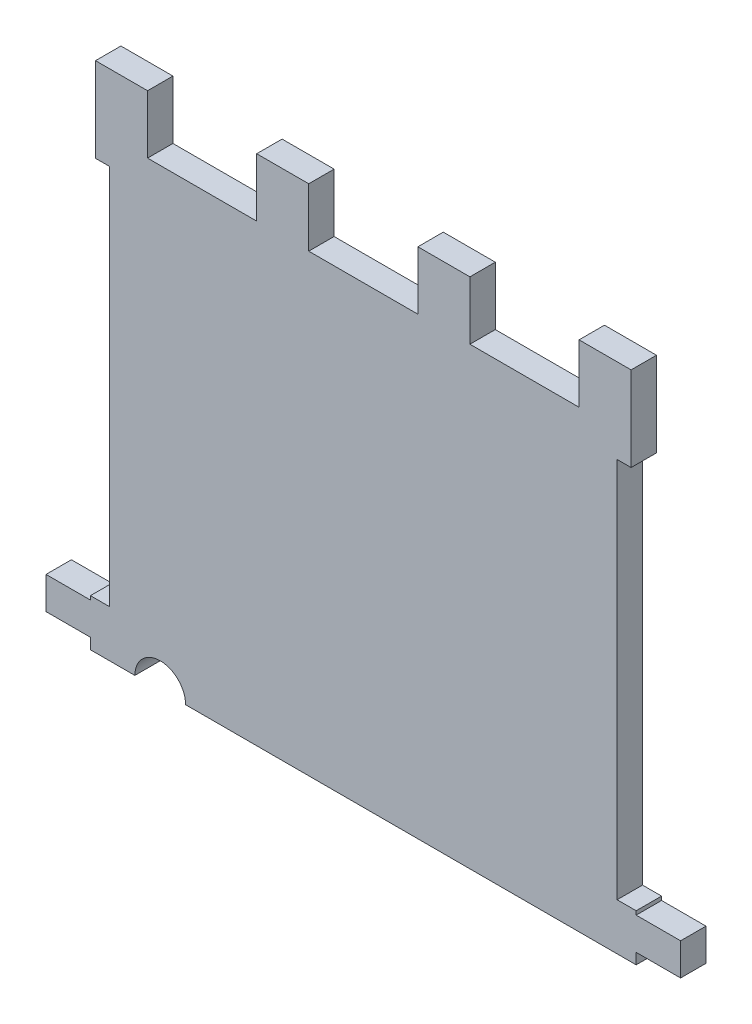
ISO-10303-21;
HEADER;
FILE_DESCRIPTION(('STEP AP214'),'2;1');
FILE_NAME('part.step','',(''),(''),'','','');
FILE_SCHEMA(('AUTOMOTIVE_DESIGN { 1 0 10303 214 1 1 1 1 }'));
ENDSEC;
DATA;
#1=APPLICATION_CONTEXT('core data for automotive mechanical design processes');
#2=APPLICATION_PROTOCOL_DEFINITION('international standard','automotive_design',2000,#1);
#3=PRODUCT_CONTEXT('',#1,'mechanical');
#4=PRODUCT('Part','Part','',(#3));
#5=PRODUCT_RELATED_PRODUCT_CATEGORY('part','',(#4));
#6=PRODUCT_DEFINITION_FORMATION('','',#4);
#7=PRODUCT_DEFINITION_CONTEXT('part definition',#1,'design');
#8=PRODUCT_DEFINITION('design','',#6,#7);
#9=PRODUCT_DEFINITION_SHAPE('','',#8);
#10=(LENGTH_UNIT() NAMED_UNIT(*) SI_UNIT(.MILLI.,.METRE.));
#11=(NAMED_UNIT(*) PLANE_ANGLE_UNIT() SI_UNIT($,.RADIAN.));
#12=(NAMED_UNIT(*) SI_UNIT($,.STERADIAN.) SOLID_ANGLE_UNIT());
#13=UNCERTAINTY_MEASURE_WITH_UNIT(LENGTH_MEASURE(1.E-05),#10,'distance_accuracy_value','');
#14=(GEOMETRIC_REPRESENTATION_CONTEXT(3) GLOBAL_UNCERTAINTY_ASSIGNED_CONTEXT((#13)) GLOBAL_UNIT_ASSIGNED_CONTEXT((#10,
#11,#12)) REPRESENTATION_CONTEXT('',''));
#15=CARTESIAN_POINT('',(0.,0.,0.));
#16=DIRECTION('',(0.,0.,1.));
#17=DIRECTION('',(1.,0.,0.));
#18=AXIS2_PLACEMENT_3D('',#15,#16,#17);
#19=CARTESIAN_POINT('',(2.15,-0.700638104142,0.));
#20=DIRECTION('',(1.,0.,0.));
#21=DIRECTION('',(0.,1.,0.));
#22=AXIS2_PLACEMENT_3D('',#19,#20,#21);
#23=PLANE('',#22);
#24=DIRECTION('',(0.,0.,1.));
#25=VECTOR('',#24,1.);
#26=CARTESIAN_POINT('',(2.15,-0.700638104142,0.));
#27=LINE('',#26,#25);
#28=CARTESIAN_POINT('',(2.15,-0.700638104142,0.));
#29=VERTEX_POINT('',#28);
#30=CARTESIAN_POINT('',(2.15,-0.700638104142,0.2));
#31=VERTEX_POINT('',#30);
#32=EDGE_CURVE('E309',#29,#31,#27,.T.);
#33=ORIENTED_EDGE('',*,*,#32,.F.);
#34=DIRECTION('',(0.,1.,0.));
#35=VECTOR('',#34,1.);
#36=CARTESIAN_POINT('',(2.15,-0.700638104142,0.));
#37=LINE('',#36,#35);
#38=CARTESIAN_POINT('',(2.15,-0.670638104142,0.));
#39=VERTEX_POINT('',#38);
#40=EDGE_CURVE('E362',#29,#39,#37,.T.);
#41=ORIENTED_EDGE('',*,*,#40,.T.);
#42=DIRECTION('',(0.,0.,1.));
#43=VECTOR('',#42,1.);
#44=CARTESIAN_POINT('',(2.15,-0.670638104142,0.));
#45=LINE('',#44,#43);
#46=CARTESIAN_POINT('',(2.15,-0.670638104142,0.2));
#47=VERTEX_POINT('',#46);
#48=EDGE_CURVE('E312',#47,#39,#45,.F.);
#49=ORIENTED_EDGE('',*,*,#48,.F.);
#50=DIRECTION('',(0.,1.,0.));
#51=VECTOR('',#50,1.);
#52=CARTESIAN_POINT('',(2.15,0.,0.2));
#53=LINE('',#52,#51);
#54=EDGE_CURVE('E359',#47,#31,#53,.F.);
#55=ORIENTED_EDGE('',*,*,#54,.T.);
#56=EDGE_LOOP('',(#33,#41,#49,#55));
#57=FACE_BOUND('',#56,.T.);
#58=ADVANCED_FACE('F17',(#57),#23,.T.);
#59=CARTESIAN_POINT('',(-2.15,-0.670638104142,0.));
#60=DIRECTION('',(-1.,0.,0.));
#61=DIRECTION('',(0.,-1.,0.));
#62=AXIS2_PLACEMENT_3D('',#59,#60,#61);
#63=PLANE('',#62);
#64=DIRECTION('',(0.,0.,1.));
#65=VECTOR('',#64,1.);
#66=CARTESIAN_POINT('',(-2.15,-0.670638104142,0.));
#67=LINE('',#66,#65);
#68=CARTESIAN_POINT('',(-2.15,-0.670638104142,0.));
#69=VERTEX_POINT('',#68);
#70=CARTESIAN_POINT('',(-2.15,-0.670638104142,0.2));
#71=VERTEX_POINT('',#70);
#72=EDGE_CURVE('E491',#69,#71,#67,.T.);
#73=ORIENTED_EDGE('',*,*,#72,.F.);
#74=DIRECTION('',(0.,-1.,0.));
#75=VECTOR('',#74,1.);
#76=CARTESIAN_POINT('',(-2.15,-0.670638104142,0.));
#77=LINE('',#76,#75);
#78=CARTESIAN_POINT('',(-2.15,-0.700638104142,0.));
#79=VERTEX_POINT('',#78);
#80=EDGE_CURVE('E360',#69,#79,#77,.T.);
#81=ORIENTED_EDGE('',*,*,#80,.T.);
#82=DIRECTION('',(0.,0.,1.));
#83=VECTOR('',#82,1.);
#84=CARTESIAN_POINT('',(-2.15,-0.700638104142,0.));
#85=LINE('',#84,#83);
#86=CARTESIAN_POINT('',(-2.15,-0.700638104142,0.2));
#87=VERTEX_POINT('',#86);
#88=EDGE_CURVE('E494',#87,#79,#85,.F.);
#89=ORIENTED_EDGE('',*,*,#88,.F.);
#90=DIRECTION('',(0.,1.,0.));
#91=VECTOR('',#90,1.);
#92=CARTESIAN_POINT('',(-2.15,0.,0.2));
#93=LINE('',#92,#91);
#94=EDGE_CURVE('E357',#87,#71,#93,.T.);
#95=ORIENTED_EDGE('',*,*,#94,.T.);
#96=EDGE_LOOP('',(#73,#81,#89,#95));
#97=FACE_BOUND('',#96,.T.);
#98=ADVANCED_FACE('F661',(#97),#63,.T.);
#99=CARTESIAN_POINT('',(0.,0.,0.2));
#100=DIRECTION('',(0.,0.,-1.));
#101=DIRECTION('',(-1.,0.,0.));
#102=AXIS2_PLACEMENT_3D('',#99,#100,#101);
#103=PLANE('',#102);
#104=DIRECTION('',(1.,0.,0.));
#105=VECTOR('',#104,1.);
#106=CARTESIAN_POINT('',(-2.11,3.,0.2));
#107=LINE('',#106,#105);
#108=CARTESIAN_POINT('',(-1.7,3.,0.2));
#109=VERTEX_POINT('',#108);
#110=CARTESIAN_POINT('',(-2.11,3.,0.2));
#111=VERTEX_POINT('',#110);
#112=EDGE_CURVE('E472',#109,#111,#107,.F.);
#113=ORIENTED_EDGE('',*,*,#112,.T.);
#114=DIRECTION('',(0.,1.,0.));
#115=VECTOR('',#114,1.);
#116=CARTESIAN_POINT('',(-2.11,2.44,0.2));
#117=LINE('',#116,#115);
#118=CARTESIAN_POINT('',(-2.11,2.333503717557,0.2));
#119=VERTEX_POINT('',#118);
#120=EDGE_CURVE('E476',#111,#119,#117,.F.);
#121=ORIENTED_EDGE('',*,*,#120,.T.);
#122=DIRECTION('',(0.999999999832969,-1.82773427514594E-05,0.));
#123=VECTOR('',#122,1.);
#124=CARTESIAN_POINT('',(-2.11,2.333504722811,0.2));
#125=LINE('',#124,#123);
#126=CARTESIAN_POINT('',(-2.,2.33350271230307,0.2));
#127=VERTEX_POINT('',#126);
#128=EDGE_CURVE('E478',#127,#119,#125,.F.);
#129=ORIENTED_EDGE('',*,*,#128,.F.);
#130=DIRECTION('',(0.,-1.,0.));
#131=VECTOR('',#130,1.);
#132=CARTESIAN_POINT('',(-2.,2.333502712303,0.2));
#133=LINE('',#132,#131);
#134=CARTESIAN_POINT('',(-2.,-0.670638104142,0.2));
#135=VERTEX_POINT('',#134);
#136=EDGE_CURVE('E484',#135,#127,#133,.F.);
#137=ORIENTED_EDGE('',*,*,#136,.F.);
#138=DIRECTION('',(-1.,0.,0.));
#139=VECTOR('',#138,1.);
#140=CARTESIAN_POINT('',(-2.,-0.670638104142,0.2));
#141=LINE('',#140,#139);
#142=EDGE_CURVE('E489',#71,#135,#141,.F.);
#143=ORIENTED_EDGE('',*,*,#142,.F.);
#144=ORIENTED_EDGE('',*,*,#94,.F.);
#145=DIRECTION('',(-1.,0.,0.));
#146=VECTOR('',#145,1.);
#147=CARTESIAN_POINT('',(-2.15,-0.700638104142,0.2));
#148=LINE('',#147,#146);
#149=CARTESIAN_POINT('',(-2.5,-0.700638104142,0.2));
#150=VERTEX_POINT('',#149);
#151=EDGE_CURVE('E497',#150,#87,#148,.F.);
#152=ORIENTED_EDGE('',*,*,#151,.F.);
#153=DIRECTION('',(0.,-1.,0.));
#154=VECTOR('',#153,1.);
#155=CARTESIAN_POINT('',(-2.5,-0.700638104142,0.2));
#156=LINE('',#155,#154);
#157=CARTESIAN_POINT('',(-2.5,-0.954638104142,0.2));
#158=VERTEX_POINT('',#157);
#159=EDGE_CURVE('E503',#158,#150,#156,.F.);
#160=ORIENTED_EDGE('',*,*,#159,.F.);
#161=DIRECTION('',(1.,-1.317019624028E-13,0.));
#162=VECTOR('',#161,1.);
#163=CARTESIAN_POINT('',(-2.5,-0.954638104142,0.2));
#164=LINE('',#163,#162);
#165=CARTESIAN_POINT('',(-2.15,-0.954638104142011,0.2));
#166=VERTEX_POINT('',#165);
#167=EDGE_CURVE('E508',#166,#158,#164,.F.);
#168=ORIENTED_EDGE('',*,*,#167,.F.);
#169=DIRECTION('',(0.,-1.,0.));
#170=VECTOR('',#169,1.);
#171=CARTESIAN_POINT('',(-2.15,-0.954638104142,0.2));
#172=LINE('',#171,#170);
#173=CARTESIAN_POINT('',(-2.15,-1.04,0.2));
#174=VERTEX_POINT('',#173);
#175=EDGE_CURVE('E367',#174,#166,#172,.F.);
#176=ORIENTED_EDGE('',*,*,#175,.F.);
#177=DIRECTION('',(1.,0.,0.));
#178=VECTOR('',#177,1.);
#179=CARTESIAN_POINT('',(-2.15,-1.04,0.2));
#180=LINE('',#179,#178);
#181=CARTESIAN_POINT('',(-1.8,-1.04,0.2));
#182=VERTEX_POINT('',#181);
#183=EDGE_CURVE('E245',#182,#174,#180,.F.);
#184=ORIENTED_EDGE('',*,*,#183,.F.);
#185=CARTESIAN_POINT('',(-1.6,-1.04,0.2));
#186=DIRECTION('',(0.,0.,1.));
#187=DIRECTION('',(1.,0.,0.));
#188=AXIS2_PLACEMENT_3D('',#185,#186,#187);
#189=CIRCLE('',#188,0.2);
#190=CARTESIAN_POINT('',(-1.4,-1.04,0.2));
#191=VERTEX_POINT('',#190);
#192=EDGE_CURVE('E20',#182,#191,#189,.F.);
#193=ORIENTED_EDGE('',*,*,#192,.T.);
#194=DIRECTION('',(1.,0.,0.));
#195=VECTOR('',#194,1.);
#196=CARTESIAN_POINT('',(-1.4,-1.04,0.2));
#197=LINE('',#196,#195);
#198=CARTESIAN_POINT('',(2.15,-1.04,0.2));
#199=VERTEX_POINT('',#198);
#200=EDGE_CURVE('E242',#199,#191,#197,.F.);
#201=ORIENTED_EDGE('',*,*,#200,.F.);
#202=DIRECTION('',(0.,1.,0.));
#203=VECTOR('',#202,1.);
#204=CARTESIAN_POINT('',(2.15,-1.04,0.2));
#205=LINE('',#204,#203);
#206=CARTESIAN_POINT('',(2.15,-0.954638104142,0.2));
#207=VERTEX_POINT('',#206);
#208=EDGE_CURVE('E266',#207,#199,#205,.F.);
#209=ORIENTED_EDGE('',*,*,#208,.F.);
#210=DIRECTION('',(1.,0.,0.));
#211=VECTOR('',#210,1.);
#212=CARTESIAN_POINT('',(2.15,-0.954638104142,0.2));
#213=LINE('',#212,#211);
#214=CARTESIAN_POINT('',(2.5,-0.954638104142,0.2));
#215=VERTEX_POINT('',#214);
#216=EDGE_CURVE('E279',#215,#207,#213,.F.);
#217=ORIENTED_EDGE('',*,*,#216,.F.);
#218=DIRECTION('',(0.,1.,0.));
#219=VECTOR('',#218,1.);
#220=CARTESIAN_POINT('',(2.5,-0.954638104142,0.2));
#221=LINE('',#220,#219);
#222=CARTESIAN_POINT('',(2.5,-0.700638104142,0.2));
#223=VERTEX_POINT('',#222);
#224=EDGE_CURVE('E290',#223,#215,#221,.F.);
#225=ORIENTED_EDGE('',*,*,#224,.F.);
#226=DIRECTION('',(-1.,0.,0.));
#227=VECTOR('',#226,1.);
#228=CARTESIAN_POINT('',(2.5,-0.700638104142,0.2));
#229=LINE('',#228,#227);
#230=EDGE_CURVE('E301',#31,#223,#229,.F.);
#231=ORIENTED_EDGE('',*,*,#230,.F.);
#232=ORIENTED_EDGE('',*,*,#54,.F.);
#233=DIRECTION('',(-1.,0.,0.));
#234=VECTOR('',#233,1.);
#235=CARTESIAN_POINT('',(2.15,-0.670638104142,0.2));
#236=LINE('',#235,#234);
#237=CARTESIAN_POINT('',(2.000020760086,-0.670638104142,0.2));
#238=VERTEX_POINT('',#237);
#239=EDGE_CURVE('E318',#238,#47,#236,.F.);
#240=ORIENTED_EDGE('',*,*,#239,.F.);
#241=DIRECTION('',(-1.82773423832494E-05,0.999999999832969,0.));
#242=VECTOR('',#241,1.);
#243=CARTESIAN_POINT('',(2.000020760086,-0.670638104142,0.2));
#244=LINE('',#243,#242);
#245=CARTESIAN_POINT('',(1.99996585236674,2.333503214462,0.2));
#246=VERTEX_POINT('',#245);
#247=EDGE_CURVE('E319',#246,#238,#244,.F.);
#248=ORIENTED_EDGE('',*,*,#247,.F.);
#249=DIRECTION('',(0.999999999832969,1.82773420736294E-05,0.));
#250=VECTOR('',#249,1.);
#251=CARTESIAN_POINT('',(1.999965852376,2.333502711679,0.2));
#252=LINE('',#251,#250);
#253=CARTESIAN_POINT('',(2.11,2.33350472281094,0.2));
#254=VERTEX_POINT('',#253);
#255=EDGE_CURVE('E324',#254,#246,#252,.F.);
#256=ORIENTED_EDGE('',*,*,#255,.F.);
#257=DIRECTION('',(0.,-1.,0.));
#258=VECTOR('',#257,1.);
#259=CARTESIAN_POINT('',(2.11,3.,0.2));
#260=LINE('',#259,#258);
#261=CARTESIAN_POINT('',(2.11,3.,0.2));
#262=VERTEX_POINT('',#261);
#263=EDGE_CURVE('E331',#254,#262,#260,.F.);
#264=ORIENTED_EDGE('',*,*,#263,.T.);
#265=DIRECTION('',(1.,0.,0.));
#266=VECTOR('',#265,1.);
#267=CARTESIAN_POINT('',(1.7,3.,0.2));
#268=LINE('',#267,#266);
#269=CARTESIAN_POINT('',(1.7,3.,0.2));
#270=VERTEX_POINT('',#269);
#271=EDGE_CURVE('E335',#262,#270,#268,.F.);
#272=ORIENTED_EDGE('',*,*,#271,.T.);
#273=DIRECTION('',(0.,1.,0.));
#274=VECTOR('',#273,1.);
#275=CARTESIAN_POINT('',(1.7,2.44,0.2));
#276=LINE('',#275,#274);
#277=CARTESIAN_POINT('',(1.7,2.540000000001,0.2));
#278=VERTEX_POINT('',#277);
#279=EDGE_CURVE('E337',#270,#278,#276,.F.);
#280=ORIENTED_EDGE('',*,*,#279,.T.);
#281=DIRECTION('',(-1.,0.,0.));
#282=VECTOR('',#281,1.);
#283=CARTESIAN_POINT('',(2.11,2.540000000001,0.2));
#284=LINE('',#283,#282);
#285=CARTESIAN_POINT('',(0.84,2.540000000001,0.2));
#286=VERTEX_POINT('',#285);
#287=EDGE_CURVE('E345',#286,#278,#284,.F.);
#288=ORIENTED_EDGE('',*,*,#287,.F.);
#289=DIRECTION('',(0.,-1.,0.));
#290=VECTOR('',#289,1.);
#291=CARTESIAN_POINT('',(0.84,3.,0.2));
#292=LINE('',#291,#290);
#293=CARTESIAN_POINT('',(0.84,3.,0.2));
#294=VERTEX_POINT('',#293);
#295=EDGE_CURVE('E349',#286,#294,#292,.F.);
#296=ORIENTED_EDGE('',*,*,#295,.T.);
#297=DIRECTION('',(1.,0.,0.));
#298=VECTOR('',#297,1.);
#299=CARTESIAN_POINT('',(0.43,3.,0.2));
#300=LINE('',#299,#298);
#301=CARTESIAN_POINT('',(0.43,3.,0.2));
#302=VERTEX_POINT('',#301);
#303=EDGE_CURVE('E353',#294,#302,#300,.F.);
#304=ORIENTED_EDGE('',*,*,#303,.T.);
#305=DIRECTION('',(0.,1.,0.));
#306=VECTOR('',#305,1.);
#307=CARTESIAN_POINT('',(0.43,2.44,0.2));
#308=LINE('',#307,#306);
#309=CARTESIAN_POINT('',(0.43,2.540000000001,0.2));
#310=VERTEX_POINT('',#309);
#311=EDGE_CURVE('E355',#302,#310,#308,.F.);
#312=ORIENTED_EDGE('',*,*,#311,.T.);
#313=DIRECTION('',(-1.,0.,0.));
#314=VECTOR('',#313,1.);
#315=CARTESIAN_POINT('',(2.11,2.540000000001,0.2));
#316=LINE('',#315,#314);
#317=CARTESIAN_POINT('',(-0.43,2.540000000001,0.2));
#318=VERTEX_POINT('',#317);
#319=EDGE_CURVE('E445',#318,#310,#316,.F.);
#320=ORIENTED_EDGE('',*,*,#319,.F.);
#321=DIRECTION('',(0.,-1.,0.));
#322=VECTOR('',#321,1.);
#323=CARTESIAN_POINT('',(-0.43,3.,0.2));
#324=LINE('',#323,#322);
#325=CARTESIAN_POINT('',(-0.43,3.,0.2));
#326=VERTEX_POINT('',#325);
#327=EDGE_CURVE('E450',#318,#326,#324,.F.);
#328=ORIENTED_EDGE('',*,*,#327,.T.);
#329=DIRECTION('',(1.,0.,0.));
#330=VECTOR('',#329,1.);
#331=CARTESIAN_POINT('',(-0.84,3.,0.2));
#332=LINE('',#331,#330);
#333=CARTESIAN_POINT('',(-0.84,3.,0.2));
#334=VERTEX_POINT('',#333);
#335=EDGE_CURVE('E454',#326,#334,#332,.F.);
#336=ORIENTED_EDGE('',*,*,#335,.T.);
#337=DIRECTION('',(0.,1.,0.));
#338=VECTOR('',#337,1.);
#339=CARTESIAN_POINT('',(-0.84,2.44,0.2));
#340=LINE('',#339,#338);
#341=CARTESIAN_POINT('',(-0.84,2.540000000001,0.2));
#342=VERTEX_POINT('',#341);
#343=EDGE_CURVE('E456',#334,#342,#340,.F.);
#344=ORIENTED_EDGE('',*,*,#343,.T.);
#345=DIRECTION('',(-1.,0.,0.));
#346=VECTOR('',#345,1.);
#347=CARTESIAN_POINT('',(2.11,2.540000000001,0.2));
#348=LINE('',#347,#346);
#349=CARTESIAN_POINT('',(-1.7,2.540000000001,0.2));
#350=VERTEX_POINT('',#349);
#351=EDGE_CURVE('E464',#350,#342,#348,.F.);
#352=ORIENTED_EDGE('',*,*,#351,.F.);
#353=DIRECTION('',(0.,-1.,0.));
#354=VECTOR('',#353,1.);
#355=CARTESIAN_POINT('',(-1.7,3.,0.2));
#356=LINE('',#355,#354);
#357=EDGE_CURVE('E468',#350,#109,#356,.F.);
#358=ORIENTED_EDGE('',*,*,#357,.T.);
#359=EDGE_LOOP('',(#113,#121,#129,#137,#143,#144,#152,#160,#168,#176,#184,#193,#201,#209,#217,
#225,#231,#232,#240,#248,#256,#264,#272,#280,#288,#296,#304,#312,#320,#328,#336,#344,#352,#358));
#360=FACE_BOUND('',#359,.T.);
#361=ADVANCED_FACE('F240',(#360),#103,.F.);
#362=CARTESIAN_POINT('',(0.43,2.44,0.));
#363=DIRECTION('',(1.,0.,0.));
#364=DIRECTION('',(0.,1.,0.));
#365=AXIS2_PLACEMENT_3D('',#362,#363,#364);
#366=PLANE('',#365);
#367=DIRECTION('',(0.,0.,1.));
#368=VECTOR('',#367,1.);
#369=CARTESIAN_POINT('',(0.43,3.,0.));
#370=LINE('',#369,#368);
#371=CARTESIAN_POINT('',(0.43,3.,0.));
#372=VERTEX_POINT('',#371);
#373=EDGE_CURVE('E351',#302,#372,#370,.F.);
#374=ORIENTED_EDGE('',*,*,#373,.T.);
#375=DIRECTION('',(0.,1.,0.));
#376=VECTOR('',#375,1.);
#377=CARTESIAN_POINT('',(0.43,0.,0.));
#378=LINE('',#377,#376);
#379=CARTESIAN_POINT('',(0.43,2.540000000001,0.));
#380=VERTEX_POINT('',#379);
#381=EDGE_CURVE('E438',#380,#372,#378,.T.);
#382=ORIENTED_EDGE('',*,*,#381,.F.);
#383=DIRECTION('',(0.,0.,1.));
#384=VECTOR('',#383,1.);
#385=CARTESIAN_POINT('',(0.43,2.540000000001,0.));
#386=LINE('',#385,#384);
#387=EDGE_CURVE('E442',#310,#380,#386,.F.);
#388=ORIENTED_EDGE('',*,*,#387,.F.);
#389=ORIENTED_EDGE('',*,*,#311,.F.);
#390=EDGE_LOOP('',(#374,#382,#388,#389));
#391=FACE_BOUND('',#390,.T.);
#392=ADVANCED_FACE('F655',(#391),#366,.F.);
#393=CARTESIAN_POINT('',(0.43,3.,0.));
#394=DIRECTION('',(0.,-1.,0.));
#395=DIRECTION('',(1.,0.,0.));
#396=AXIS2_PLACEMENT_3D('',#393,#394,#395);
#397=PLANE('',#396);
#398=ORIENTED_EDGE('',*,*,#303,.F.);
#399=DIRECTION('',(0.,0.,1.));
#400=VECTOR('',#399,1.);
#401=CARTESIAN_POINT('',(0.84,3.,0.));
#402=LINE('',#401,#400);
#403=CARTESIAN_POINT('',(0.84,3.,0.));
#404=VERTEX_POINT('',#403);
#405=EDGE_CURVE('E347',#294,#404,#402,.F.);
#406=ORIENTED_EDGE('',*,*,#405,.T.);
#407=DIRECTION('',(-1.,0.,0.));
#408=VECTOR('',#407,1.);
#409=CARTESIAN_POINT('',(0.,3.,0.));
#410=LINE('',#409,#408);
#411=EDGE_CURVE('E435',#372,#404,#410,.F.);
#412=ORIENTED_EDGE('',*,*,#411,.F.);
#413=ORIENTED_EDGE('',*,*,#373,.F.);
#414=EDGE_LOOP('',(#398,#406,#412,#413));
#415=FACE_BOUND('',#414,.T.);
#416=ADVANCED_FACE('F651',(#415),#397,.F.);
#417=CARTESIAN_POINT('',(0.84,3.,0.));
#418=DIRECTION('',(-1.,0.,0.));
#419=DIRECTION('',(0.,-1.,0.));
#420=AXIS2_PLACEMENT_3D('',#417,#418,#419);
#421=PLANE('',#420);
#422=ORIENTED_EDGE('',*,*,#405,.F.);
#423=ORIENTED_EDGE('',*,*,#295,.F.);
#424=DIRECTION('',(0.,0.,1.));
#425=VECTOR('',#424,1.);
#426=CARTESIAN_POINT('',(0.84,2.540000000001,0.));
#427=LINE('',#426,#425);
#428=CARTESIAN_POINT('',(0.84,2.540000000001,0.));
#429=VERTEX_POINT('',#428);
#430=EDGE_CURVE('E342',#429,#286,#427,.T.);
#431=ORIENTED_EDGE('',*,*,#430,.F.);
#432=DIRECTION('',(0.,1.,0.));
#433=VECTOR('',#432,1.);
#434=CARTESIAN_POINT('',(0.84,0.,0.));
#435=LINE('',#434,#433);
#436=EDGE_CURVE('E432',#404,#429,#435,.F.);
#437=ORIENTED_EDGE('',*,*,#436,.F.);
#438=EDGE_LOOP('',(#422,#423,#431,#437));
#439=FACE_BOUND('',#438,.T.);
#440=ADVANCED_FACE('F647',(#439),#421,.F.);
#441=CARTESIAN_POINT('',(2.11,2.540000000001,0.));
#442=DIRECTION('',(0.,1.,0.));
#443=DIRECTION('',(-1.,0.,0.));
#444=AXIS2_PLACEMENT_3D('',#441,#442,#443);
#445=PLANE('',#444);
#446=DIRECTION('',(-1.,0.,0.));
#447=VECTOR('',#446,1.);
#448=CARTESIAN_POINT('',(0.,2.540000000001,0.));
#449=LINE('',#448,#447);
#450=CARTESIAN_POINT('',(1.7,2.540000000001,0.));
#451=VERTEX_POINT('',#450);
#452=EDGE_CURVE('E429',#429,#451,#449,.F.);
#453=ORIENTED_EDGE('',*,*,#452,.F.);
#454=ORIENTED_EDGE('',*,*,#430,.T.);
#455=ORIENTED_EDGE('',*,*,#287,.T.);
#456=DIRECTION('',(0.,0.,1.));
#457=VECTOR('',#456,1.);
#458=CARTESIAN_POINT('',(1.7,2.540000000001,0.));
#459=LINE('',#458,#457);
#460=EDGE_CURVE('E340',#278,#451,#459,.F.);
#461=ORIENTED_EDGE('',*,*,#460,.T.);
#462=EDGE_LOOP('',(#453,#454,#455,#461));
#463=FACE_BOUND('',#462,.T.);
#464=ADVANCED_FACE('F643',(#463),#445,.T.);
#465=CARTESIAN_POINT('',(1.7,2.44,0.));
#466=DIRECTION('',(1.,0.,0.));
#467=DIRECTION('',(0.,1.,0.));
#468=AXIS2_PLACEMENT_3D('',#465,#466,#467);
#469=PLANE('',#468);
#470=DIRECTION('',(0.,0.,1.));
#471=VECTOR('',#470,1.);
#472=CARTESIAN_POINT('',(1.7,3.,0.));
#473=LINE('',#472,#471);
#474=CARTESIAN_POINT('',(1.7,3.,0.));
#475=VERTEX_POINT('',#474);
#476=EDGE_CURVE('E333',#270,#475,#473,.F.);
#477=ORIENTED_EDGE('',*,*,#476,.T.);
#478=DIRECTION('',(0.,1.,0.));
#479=VECTOR('',#478,1.);
#480=CARTESIAN_POINT('',(1.7,0.,0.));
#481=LINE('',#480,#479);
#482=EDGE_CURVE('E426',#451,#475,#481,.T.);
#483=ORIENTED_EDGE('',*,*,#482,.F.);
#484=ORIENTED_EDGE('',*,*,#460,.F.);
#485=ORIENTED_EDGE('',*,*,#279,.F.);
#486=EDGE_LOOP('',(#477,#483,#484,#485));
#487=FACE_BOUND('',#486,.T.);
#488=ADVANCED_FACE('F639',(#487),#469,.F.);
#489=CARTESIAN_POINT('',(1.7,3.,0.));
#490=DIRECTION('',(0.,-1.,0.));
#491=DIRECTION('',(1.,0.,0.));
#492=AXIS2_PLACEMENT_3D('',#489,#490,#491);
#493=PLANE('',#492);
#494=ORIENTED_EDGE('',*,*,#271,.F.);
#495=DIRECTION('',(0.,0.,1.));
#496=VECTOR('',#495,1.);
#497=CARTESIAN_POINT('',(2.11,3.,0.));
#498=LINE('',#497,#496);
#499=CARTESIAN_POINT('',(2.11,3.,0.));
#500=VERTEX_POINT('',#499);
#501=EDGE_CURVE('E329',#262,#500,#498,.F.);
#502=ORIENTED_EDGE('',*,*,#501,.T.);
#503=DIRECTION('',(-1.,0.,0.));
#504=VECTOR('',#503,1.);
#505=CARTESIAN_POINT('',(0.,3.,0.));
#506=LINE('',#505,#504);
#507=EDGE_CURVE('E423',#475,#500,#506,.F.);
#508=ORIENTED_EDGE('',*,*,#507,.F.);
#509=ORIENTED_EDGE('',*,*,#476,.F.);
#510=EDGE_LOOP('',(#494,#502,#508,#509));
#511=FACE_BOUND('',#510,.T.);
#512=ADVANCED_FACE('F635',(#511),#493,.F.);
#513=CARTESIAN_POINT('',(2.11,3.,0.));
#514=DIRECTION('',(-1.,0.,0.));
#515=DIRECTION('',(0.,-1.,0.));
#516=AXIS2_PLACEMENT_3D('',#513,#514,#515);
#517=PLANE('',#516);
#518=ORIENTED_EDGE('',*,*,#263,.F.);
#519=DIRECTION('',(0.,0.,1.));
#520=VECTOR('',#519,1.);
#521=CARTESIAN_POINT('',(2.11,2.33350472281076,0.));
#522=LINE('',#521,#520);
#523=CARTESIAN_POINT('',(2.11,2.33350472281094,0.));
#524=VERTEX_POINT('',#523);
#525=EDGE_CURVE('E326',#524,#254,#522,.T.);
#526=ORIENTED_EDGE('',*,*,#525,.F.);
#527=DIRECTION('',(0.,1.,0.));
#528=VECTOR('',#527,1.);
#529=CARTESIAN_POINT('',(2.11,0.,0.));
#530=LINE('',#529,#528);
#531=EDGE_CURVE('E420',#500,#524,#530,.F.);
#532=ORIENTED_EDGE('',*,*,#531,.F.);
#533=ORIENTED_EDGE('',*,*,#501,.F.);
#534=EDGE_LOOP('',(#518,#526,#532,#533));
#535=FACE_BOUND('',#534,.T.);
#536=ADVANCED_FACE('F631',(#535),#517,.F.);
#537=CARTESIAN_POINT('',(1.999965852376,2.333502711679,0.));
#538=DIRECTION('',(1.82773420736294E-05,-0.999999999832969,0.));
#539=DIRECTION('',(0.999999999832969,1.82773420736294E-05,0.));
#540=AXIS2_PLACEMENT_3D('',#537,#538,#539);
#541=PLANE('',#540);
#542=DIRECTION('',(0.,0.,1.));
#543=VECTOR('',#542,1.);
#544=CARTESIAN_POINT('',(1.99996585237573,2.333502711679,0.));
#545=LINE('',#544,#543);
#546=CARTESIAN_POINT('',(1.99996585236674,2.333503214462,0.));
#547=VERTEX_POINT('',#546);
#548=EDGE_CURVE('E321',#547,#246,#545,.T.);
#549=ORIENTED_EDGE('',*,*,#548,.F.);
#550=DIRECTION('',(-1.,0.,0.));
#551=VECTOR('',#550,1.);
#552=CARTESIAN_POINT('',(0.,2.333504722811,0.));
#553=LINE('',#552,#551);
#554=EDGE_CURVE('E417',#524,#547,#553,.T.);
#555=ORIENTED_EDGE('',*,*,#554,.F.);
#556=ORIENTED_EDGE('',*,*,#525,.T.);
#557=ORIENTED_EDGE('',*,*,#255,.T.);
#558=EDGE_LOOP('',(#549,#555,#556,#557));
#559=FACE_BOUND('',#558,.T.);
#560=ADVANCED_FACE('F627',(#559),#541,.T.);
#561=CARTESIAN_POINT('',(2.000020760086,-0.670638104142,0.));
#562=DIRECTION('',(0.999999999832969,1.82773423832494E-05,0.));
#563=DIRECTION('',(-1.82773423832494E-05,0.999999999832969,0.));
#564=AXIS2_PLACEMENT_3D('',#561,#562,#563);
#565=PLANE('',#564);
#566=DIRECTION('',(0.,0.,1.));
#567=VECTOR('',#566,1.);
#568=CARTESIAN_POINT('',(2.000020760086,-0.670638104142,0.));
#569=LINE('',#568,#567);
#570=CARTESIAN_POINT('',(2.000020760086,-0.670638104142,0.));
#571=VERTEX_POINT('',#570);
#572=EDGE_CURVE('E315',#571,#238,#569,.T.);
#573=ORIENTED_EDGE('',*,*,#572,.F.);
#574=DIRECTION('',(1.82773422943122E-05,-0.999999999832969,0.));
#575=VECTOR('',#574,1.);
#576=CARTESIAN_POINT('',(1.999965852376,2.333502711679,0.));
#577=LINE('',#576,#575);
#578=EDGE_CURVE('E402',#547,#571,#577,.T.);
#579=ORIENTED_EDGE('',*,*,#578,.F.);
#580=ORIENTED_EDGE('',*,*,#548,.T.);
#581=ORIENTED_EDGE('',*,*,#247,.T.);
#582=EDGE_LOOP('',(#573,#579,#580,#581));
#583=FACE_BOUND('',#582,.T.);
#584=ADVANCED_FACE('F623',(#583),#565,.T.);
#585=CARTESIAN_POINT('',(2.15,-0.670638104142,0.));
#586=DIRECTION('',(0.,1.,0.));
#587=DIRECTION('',(-1.,0.,0.));
#588=AXIS2_PLACEMENT_3D('',#585,#586,#587);
#589=PLANE('',#588);
#590=ORIENTED_EDGE('',*,*,#48,.T.);
#591=DIRECTION('',(-1.,0.,0.));
#592=VECTOR('',#591,1.);
#593=CARTESIAN_POINT('',(0.,-0.670638104142,0.));
#594=LINE('',#593,#592);
#595=EDGE_CURVE('E306',#571,#39,#594,.F.);
#596=ORIENTED_EDGE('',*,*,#595,.F.);
#597=ORIENTED_EDGE('',*,*,#572,.T.);
#598=ORIENTED_EDGE('',*,*,#239,.T.);
#599=EDGE_LOOP('',(#590,#596,#597,#598));
#600=FACE_BOUND('',#599,.T.);
#601=ADVANCED_FACE('F619',(#600),#589,.T.);
#602=CARTESIAN_POINT('',(2.5,-0.700638104142,0.));
#603=DIRECTION('',(0.,1.,0.));
#604=DIRECTION('',(-1.,0.,0.));
#605=AXIS2_PLACEMENT_3D('',#602,#603,#604);
#606=PLANE('',#605);
#607=DIRECTION('',(0.,0.,1.));
#608=VECTOR('',#607,1.);
#609=CARTESIAN_POINT('',(2.5,-0.700638104142,0.));
#610=LINE('',#609,#608);
#611=CARTESIAN_POINT('',(2.5,-0.700638104142,0.));
#612=VERTEX_POINT('',#611);
#613=EDGE_CURVE('E298',#612,#223,#610,.T.);
#614=ORIENTED_EDGE('',*,*,#613,.F.);
#615=DIRECTION('',(-1.,0.,0.));
#616=VECTOR('',#615,1.);
#617=CARTESIAN_POINT('',(0.,-0.700638104142,0.));
#618=LINE('',#617,#616);
#619=EDGE_CURVE('E295',#29,#612,#618,.F.);
#620=ORIENTED_EDGE('',*,*,#619,.F.);
#621=ORIENTED_EDGE('',*,*,#32,.T.);
#622=ORIENTED_EDGE('',*,*,#230,.T.);
#623=EDGE_LOOP('',(#614,#620,#621,#622));
#624=FACE_BOUND('',#623,.T.);
#625=ADVANCED_FACE('F615',(#624),#606,.T.);
#626=CARTESIAN_POINT('',(2.5,-0.954638104142,0.));
#627=DIRECTION('',(1.,0.,0.));
#628=DIRECTION('',(0.,1.,0.));
#629=AXIS2_PLACEMENT_3D('',#626,#627,#628);
#630=PLANE('',#629);
#631=DIRECTION('',(0.,0.,1.));
#632=VECTOR('',#631,1.);
#633=CARTESIAN_POINT('',(2.5,-0.954638104142,0.));
#634=LINE('',#633,#632);
#635=CARTESIAN_POINT('',(2.5,-0.954638104142,0.));
#636=VERTEX_POINT('',#635);
#637=EDGE_CURVE('E287',#636,#215,#634,.T.);
#638=ORIENTED_EDGE('',*,*,#637,.F.);
#639=DIRECTION('',(0.,1.,0.));
#640=VECTOR('',#639,1.);
#641=CARTESIAN_POINT('',(2.5,0.,0.));
#642=LINE('',#641,#640);
#643=EDGE_CURVE('E284',#612,#636,#642,.F.);
#644=ORIENTED_EDGE('',*,*,#643,.F.);
#645=ORIENTED_EDGE('',*,*,#613,.T.);
#646=ORIENTED_EDGE('',*,*,#224,.T.);
#647=EDGE_LOOP('',(#638,#644,#645,#646));
#648=FACE_BOUND('',#647,.T.);
#649=ADVANCED_FACE('F611',(#648),#630,.T.);
#650=CARTESIAN_POINT('',(2.15,-0.954638104142,0.));
#651=DIRECTION('',(0.,-1.,0.));
#652=DIRECTION('',(1.,0.,0.));
#653=AXIS2_PLACEMENT_3D('',#650,#651,#652);
#654=PLANE('',#653);
#655=DIRECTION('',(0.,0.,1.));
#656=VECTOR('',#655,1.);
#657=CARTESIAN_POINT('',(2.15,-0.954638104142,0.));
#658=LINE('',#657,#656);
#659=CARTESIAN_POINT('',(2.15,-0.954638104142,0.));
#660=VERTEX_POINT('',#659);
#661=EDGE_CURVE('E276',#660,#207,#658,.T.);
#662=ORIENTED_EDGE('',*,*,#661,.F.);
#663=DIRECTION('',(-1.,0.,0.));
#664=VECTOR('',#663,1.);
#665=CARTESIAN_POINT('',(0.,-0.954638104142,0.));
#666=LINE('',#665,#664);
#667=EDGE_CURVE('E273',#636,#660,#666,.T.);
#668=ORIENTED_EDGE('',*,*,#667,.F.);
#669=ORIENTED_EDGE('',*,*,#637,.T.);
#670=ORIENTED_EDGE('',*,*,#216,.T.);
#671=EDGE_LOOP('',(#662,#668,#669,#670));
#672=FACE_BOUND('',#671,.T.);
#673=ADVANCED_FACE('F607',(#672),#654,.T.);
#674=CARTESIAN_POINT('',(2.15,-1.04,0.));
#675=DIRECTION('',(1.,0.,0.));
#676=DIRECTION('',(0.,1.,0.));
#677=AXIS2_PLACEMENT_3D('',#674,#675,#676);
#678=PLANE('',#677);
#679=DIRECTION('',(0.,0.,1.));
#680=VECTOR('',#679,1.);
#681=CARTESIAN_POINT('',(2.15,-1.04,0.));
#682=LINE('',#681,#680);
#683=CARTESIAN_POINT('',(2.15,-1.04,0.));
#684=VERTEX_POINT('',#683);
#685=EDGE_CURVE('E252',#684,#199,#682,.T.);
#686=ORIENTED_EDGE('',*,*,#685,.F.);
#687=DIRECTION('',(0.,1.,0.));
#688=VECTOR('',#687,1.);
#689=CARTESIAN_POINT('',(2.15,0.,0.));
#690=LINE('',#689,#688);
#691=EDGE_CURVE('E269',#660,#684,#690,.F.);
#692=ORIENTED_EDGE('',*,*,#691,.F.);
#693=ORIENTED_EDGE('',*,*,#661,.T.);
#694=ORIENTED_EDGE('',*,*,#208,.T.);
#695=EDGE_LOOP('',(#686,#692,#693,#694));
#696=FACE_BOUND('',#695,.T.);
#697=ADVANCED_FACE('F604',(#696),#678,.T.);
#698=CARTESIAN_POINT('',(-1.4,-1.04,0.));
#699=DIRECTION('',(0.,-1.,0.));
#700=DIRECTION('',(1.,0.,0.));
#701=AXIS2_PLACEMENT_3D('',#698,#699,#700);
#702=PLANE('',#701);
#703=DIRECTION('',(0.,0.,1.));
#704=VECTOR('',#703,1.);
#705=CARTESIAN_POINT('',(-1.4,-1.04,0.));
#706=LINE('',#705,#704);
#707=CARTESIAN_POINT('',(-1.4,-1.04,0.));
#708=VERTEX_POINT('',#707);
#709=EDGE_CURVE('E247',#191,#708,#706,.F.);
#710=ORIENTED_EDGE('',*,*,#709,.T.);
#711=DIRECTION('',(-1.,0.,0.));
#712=VECTOR('',#711,1.);
#713=CARTESIAN_POINT('',(0.,-1.04,0.));
#714=LINE('',#713,#712);
#715=EDGE_CURVE('E272',#684,#708,#714,.T.);
#716=ORIENTED_EDGE('',*,*,#715,.F.);
#717=ORIENTED_EDGE('',*,*,#685,.T.);
#718=ORIENTED_EDGE('',*,*,#200,.T.);
#719=EDGE_LOOP('',(#710,#716,#717,#718));
#720=FACE_BOUND('',#719,.T.);
#721=ADVANCED_FACE('F249',(#720),#702,.T.);
#722=CARTESIAN_POINT('',(-1.6,-1.04,0.));
#723=DIRECTION('',(0.,0.,1.));
#724=DIRECTION('',(1.,0.,0.));
#725=AXIS2_PLACEMENT_3D('',#722,#723,#724);
#726=CYLINDRICAL_SURFACE('',#725,0.2);
#727=ORIENTED_EDGE('',*,*,#192,.F.);
#728=DIRECTION('',(0.,0.,1.));
#729=VECTOR('',#728,1.);
#730=CARTESIAN_POINT('',(-1.8,-1.04,0.));
#731=LINE('',#730,#729);
#732=CARTESIAN_POINT('',(-1.8,-1.04,0.));
#733=VERTEX_POINT('',#732);
#734=EDGE_CURVE('E258',#733,#182,#731,.T.);
#735=ORIENTED_EDGE('',*,*,#734,.F.);
#736=CARTESIAN_POINT('',(-1.6,-1.04,0.));
#737=DIRECTION('',(0.,0.,1.));
#738=DIRECTION('',(1.,0.,0.));
#739=AXIS2_PLACEMENT_3D('',#736,#737,#738);
#740=CIRCLE('',#739,0.2);
#741=EDGE_CURVE('E256',#708,#733,#740,.T.);
#742=ORIENTED_EDGE('',*,*,#741,.F.);
#743=ORIENTED_EDGE('',*,*,#709,.F.);
#744=EDGE_LOOP('',(#727,#735,#742,#743));
#745=FACE_BOUND('',#744,.T.);
#746=ADVANCED_FACE('F254',(#745),#726,.F.);
#747=CARTESIAN_POINT('',(-2.15,-1.04,0.));
#748=DIRECTION('',(0.,-1.,0.));
#749=DIRECTION('',(1.,0.,0.));
#750=AXIS2_PLACEMENT_3D('',#747,#748,#749);
#751=PLANE('',#750);
#752=DIRECTION('',(0.,0.,1.));
#753=VECTOR('',#752,1.);
#754=CARTESIAN_POINT('',(-2.15,-1.04,0.));
#755=LINE('',#754,#753);
#756=CARTESIAN_POINT('',(-2.15,-1.04,0.));
#757=VERTEX_POINT('',#756);
#758=EDGE_CURVE('E364',#757,#174,#755,.T.);
#759=ORIENTED_EDGE('',*,*,#758,.F.);
#760=DIRECTION('',(-1.,0.,0.));
#761=VECTOR('',#760,1.);
#762=CARTESIAN_POINT('',(0.,-1.04,0.));
#763=LINE('',#762,#761);
#764=EDGE_CURVE('E404',#733,#757,#763,.T.);
#765=ORIENTED_EDGE('',*,*,#764,.F.);
#766=ORIENTED_EDGE('',*,*,#734,.T.);
#767=ORIENTED_EDGE('',*,*,#183,.T.);
#768=EDGE_LOOP('',(#759,#765,#766,#767));
#769=FACE_BOUND('',#768,.T.);
#770=ADVANCED_FACE('F523',(#769),#751,.T.);
#771=CARTESIAN_POINT('',(-2.15,-0.954638104142,0.));
#772=DIRECTION('',(-1.,0.,0.));
#773=DIRECTION('',(0.,-1.,0.));
#774=AXIS2_PLACEMENT_3D('',#771,#772,#773);
#775=PLANE('',#774);
#776=DIRECTION('',(0.,0.,1.));
#777=VECTOR('',#776,1.);
#778=CARTESIAN_POINT('',(-2.15,-0.954638104142046,0.));
#779=LINE('',#778,#777);
#780=CARTESIAN_POINT('',(-2.15,-0.954638104142011,0.));
#781=VERTEX_POINT('',#780);
#782=EDGE_CURVE('E369',#781,#166,#779,.T.);
#783=ORIENTED_EDGE('',*,*,#782,.F.);
#784=DIRECTION('',(0.,1.,0.));
#785=VECTOR('',#784,1.);
#786=CARTESIAN_POINT('',(-2.15,0.,0.));
#787=LINE('',#786,#785);
#788=EDGE_CURVE('E407',#757,#781,#787,.T.);
#789=ORIENTED_EDGE('',*,*,#788,.F.);
#790=ORIENTED_EDGE('',*,*,#758,.T.);
#791=ORIENTED_EDGE('',*,*,#175,.T.);
#792=EDGE_LOOP('',(#783,#789,#790,#791));
#793=FACE_BOUND('',#792,.T.);
#794=ADVANCED_FACE('F519',(#793),#775,.T.);
#795=CARTESIAN_POINT('',(-2.5,-0.954638104142,0.));
#796=DIRECTION('',(-1.317019624028E-13,-1.,0.));
#797=DIRECTION('',(1.,-1.317019624028E-13,0.));
#798=AXIS2_PLACEMENT_3D('',#795,#796,#797);
#799=PLANE('',#798);
#800=DIRECTION('',(0.,0.,1.));
#801=VECTOR('',#800,1.);
#802=CARTESIAN_POINT('',(-2.5,-0.954638104142,0.));
#803=LINE('',#802,#801);
#804=CARTESIAN_POINT('',(-2.5,-0.954638104142,0.));
#805=VERTEX_POINT('',#804);
#806=EDGE_CURVE('E505',#805,#158,#803,.T.);
#807=ORIENTED_EDGE('',*,*,#806,.F.);
#808=DIRECTION('',(-1.,0.,0.));
#809=VECTOR('',#808,1.);
#810=CARTESIAN_POINT('',(0.,-0.954638104142,0.));
#811=LINE('',#810,#809);
#812=EDGE_CURVE('E514',#781,#805,#811,.T.);
#813=ORIENTED_EDGE('',*,*,#812,.F.);
#814=ORIENTED_EDGE('',*,*,#782,.T.);
#815=ORIENTED_EDGE('',*,*,#167,.T.);
#816=EDGE_LOOP('',(#807,#813,#814,#815));
#817=FACE_BOUND('',#816,.T.);
#818=ADVANCED_FACE('F528',(#817),#799,.T.);
#819=CARTESIAN_POINT('',(-2.5,-0.700638104142,0.));
#820=DIRECTION('',(-1.,0.,0.));
#821=DIRECTION('',(0.,-1.,0.));
#822=AXIS2_PLACEMENT_3D('',#819,#820,#821);
#823=PLANE('',#822);
#824=DIRECTION('',(0.,0.,1.));
#825=VECTOR('',#824,1.);
#826=CARTESIAN_POINT('',(-2.5,-0.700638104142,0.));
#827=LINE('',#826,#825);
#828=CARTESIAN_POINT('',(-2.5,-0.700638104142,0.));
#829=VERTEX_POINT('',#828);
#830=EDGE_CURVE('E500',#829,#150,#827,.T.);
#831=ORIENTED_EDGE('',*,*,#830,.F.);
#832=DIRECTION('',(0.,1.,0.));
#833=VECTOR('',#832,1.);
#834=CARTESIAN_POINT('',(-2.5,0.,0.));
#835=LINE('',#834,#833);
#836=EDGE_CURVE('E532',#805,#829,#835,.T.);
#837=ORIENTED_EDGE('',*,*,#836,.F.);
#838=ORIENTED_EDGE('',*,*,#806,.T.);
#839=ORIENTED_EDGE('',*,*,#159,.T.);
#840=EDGE_LOOP('',(#831,#837,#838,#839));
#841=FACE_BOUND('',#840,.T.);
#842=ADVANCED_FACE('F589',(#841),#823,.T.);
#843=CARTESIAN_POINT('',(-2.15,-0.700638104142,0.));
#844=DIRECTION('',(0.,1.,0.));
#845=DIRECTION('',(-1.,0.,0.));
#846=AXIS2_PLACEMENT_3D('',#843,#844,#845);
#847=PLANE('',#846);
#848=ORIENTED_EDGE('',*,*,#88,.T.);
#849=DIRECTION('',(-1.,0.,0.));
#850=VECTOR('',#849,1.);
#851=CARTESIAN_POINT('',(0.,-0.700638104142,0.));
#852=LINE('',#851,#850);
#853=EDGE_CURVE('E677',#829,#79,#852,.F.);
#854=ORIENTED_EDGE('',*,*,#853,.F.);
#855=ORIENTED_EDGE('',*,*,#830,.T.);
#856=ORIENTED_EDGE('',*,*,#151,.T.);
#857=EDGE_LOOP('',(#848,#854,#855,#856));
#858=FACE_BOUND('',#857,.T.);
#859=ADVANCED_FACE('F585',(#858),#847,.T.);
#860=CARTESIAN_POINT('',(-2.,-0.670638104142,0.));
#861=DIRECTION('',(0.,1.,0.));
#862=DIRECTION('',(-1.,0.,0.));
#863=AXIS2_PLACEMENT_3D('',#860,#861,#862);
#864=PLANE('',#863);
#865=DIRECTION('',(0.,0.,1.));
#866=VECTOR('',#865,1.);
#867=CARTESIAN_POINT('',(-2.,-0.670638104142,0.));
#868=LINE('',#867,#866);
#869=CARTESIAN_POINT('',(-2.,-0.670638104142,0.));
#870=VERTEX_POINT('',#869);
#871=EDGE_CURVE('E486',#870,#135,#868,.T.);
#872=ORIENTED_EDGE('',*,*,#871,.F.);
#873=DIRECTION('',(-1.,0.,0.));
#874=VECTOR('',#873,1.);
#875=CARTESIAN_POINT('',(0.,-0.670638104142,0.));
#876=LINE('',#875,#874);
#877=EDGE_CURVE('E673',#69,#870,#876,.F.);
#878=ORIENTED_EDGE('',*,*,#877,.F.);
#879=ORIENTED_EDGE('',*,*,#72,.T.);
#880=ORIENTED_EDGE('',*,*,#142,.T.);
#881=EDGE_LOOP('',(#872,#878,#879,#880));
#882=FACE_BOUND('',#881,.T.);
#883=ADVANCED_FACE('F581',(#882),#864,.T.);
#884=CARTESIAN_POINT('',(-2.,2.333502712303,0.));
#885=DIRECTION('',(-1.,0.,0.));
#886=DIRECTION('',(0.,-1.,0.));
#887=AXIS2_PLACEMENT_3D('',#884,#885,#886);
#888=PLANE('',#887);
#889=DIRECTION('',(0.,0.,1.));
#890=VECTOR('',#889,1.);
#891=CARTESIAN_POINT('',(-2.,2.3335027123033,0.));
#892=LINE('',#891,#890);
#893=CARTESIAN_POINT('',(-2.,2.33350271230307,0.));
#894=VERTEX_POINT('',#893);
#895=EDGE_CURVE('E481',#894,#127,#892,.T.);
#896=ORIENTED_EDGE('',*,*,#895,.F.);
#897=DIRECTION('',(0.,1.,0.));
#898=VECTOR('',#897,1.);
#899=CARTESIAN_POINT('',(-2.,0.,0.));
#900=LINE('',#899,#898);
#901=EDGE_CURVE('E676',#870,#894,#900,.T.);
#902=ORIENTED_EDGE('',*,*,#901,.F.);
#903=ORIENTED_EDGE('',*,*,#871,.T.);
#904=ORIENTED_EDGE('',*,*,#136,.T.);
#905=EDGE_LOOP('',(#896,#902,#903,#904));
#906=FACE_BOUND('',#905,.T.);
#907=ADVANCED_FACE('F577',(#906),#888,.T.);
#908=CARTESIAN_POINT('',(-2.11,2.333504722811,0.));
#909=DIRECTION('',(-1.82773427514594E-05,-0.999999999832969,0.));
#910=DIRECTION('',(0.999999999832969,-1.82773427514594E-05,0.));
#911=AXIS2_PLACEMENT_3D('',#908,#909,#910);
#912=PLANE('',#911);
#913=DIRECTION('',(0.,0.,1.));
#914=VECTOR('',#913,1.);
#915=CARTESIAN_POINT('',(-2.11,2.333504722811,0.));
#916=LINE('',#915,#914);
#917=CARTESIAN_POINT('',(-2.11,2.333504220184,0.));
#918=VERTEX_POINT('',#917);
#919=EDGE_CURVE('E474',#119,#918,#916,.F.);
#920=ORIENTED_EDGE('',*,*,#919,.T.);
#921=DIRECTION('',(-1.,0.,0.));
#922=VECTOR('',#921,1.);
#923=CARTESIAN_POINT('',(0.,2.333502712303,0.));
#924=LINE('',#923,#922);
#925=EDGE_CURVE('E679',#894,#918,#924,.T.);
#926=ORIENTED_EDGE('',*,*,#925,.F.);
#927=ORIENTED_EDGE('',*,*,#895,.T.);
#928=ORIENTED_EDGE('',*,*,#128,.T.);
#929=EDGE_LOOP('',(#920,#926,#927,#928));
#930=FACE_BOUND('',#929,.T.);
#931=ADVANCED_FACE('F573',(#930),#912,.T.);
#932=CARTESIAN_POINT('',(-2.11,2.44,0.));
#933=DIRECTION('',(1.,0.,0.));
#934=DIRECTION('',(0.,1.,0.));
#935=AXIS2_PLACEMENT_3D('',#932,#933,#934);
#936=PLANE('',#935);
#937=DIRECTION('',(0.,1.,0.));
#938=VECTOR('',#937,1.);
#939=CARTESIAN_POINT('',(-2.11,0.,0.));
#940=LINE('',#939,#938);
#941=CARTESIAN_POINT('',(-2.11,3.,0.));
#942=VERTEX_POINT('',#941);
#943=EDGE_CURVE('E693',#918,#942,#940,.T.);
#944=ORIENTED_EDGE('',*,*,#943,.F.);
#945=ORIENTED_EDGE('',*,*,#919,.F.);
#946=ORIENTED_EDGE('',*,*,#120,.F.);
#947=DIRECTION('',(0.,0.,1.));
#948=VECTOR('',#947,1.);
#949=CARTESIAN_POINT('',(-2.11,3.,0.));
#950=LINE('',#949,#948);
#951=EDGE_CURVE('E470',#111,#942,#950,.F.);
#952=ORIENTED_EDGE('',*,*,#951,.T.);
#953=EDGE_LOOP('',(#944,#945,#946,#952));
#954=FACE_BOUND('',#953,.T.);
#955=ADVANCED_FACE('F569',(#954),#936,.F.);
#956=CARTESIAN_POINT('',(-2.11,3.,0.));
#957=DIRECTION('',(0.,-1.,0.));
#958=DIRECTION('',(1.,0.,0.));
#959=AXIS2_PLACEMENT_3D('',#956,#957,#958);
#960=PLANE('',#959);
#961=ORIENTED_EDGE('',*,*,#112,.F.);
#962=DIRECTION('',(0.,0.,1.));
#963=VECTOR('',#962,1.);
#964=CARTESIAN_POINT('',(-1.7,3.,0.));
#965=LINE('',#964,#963);
#966=CARTESIAN_POINT('',(-1.7,3.,0.));
#967=VERTEX_POINT('',#966);
#968=EDGE_CURVE('E466',#109,#967,#965,.F.);
#969=ORIENTED_EDGE('',*,*,#968,.T.);
#970=DIRECTION('',(-1.,0.,0.));
#971=VECTOR('',#970,1.);
#972=CARTESIAN_POINT('',(0.,3.,0.));
#973=LINE('',#972,#971);
#974=EDGE_CURVE('E694',#942,#967,#973,.F.);
#975=ORIENTED_EDGE('',*,*,#974,.F.);
#976=ORIENTED_EDGE('',*,*,#951,.F.);
#977=EDGE_LOOP('',(#961,#969,#975,#976));
#978=FACE_BOUND('',#977,.T.);
#979=ADVANCED_FACE('F565',(#978),#960,.F.);
#980=CARTESIAN_POINT('',(-1.7,3.,0.));
#981=DIRECTION('',(-1.,0.,0.));
#982=DIRECTION('',(0.,-1.,0.));
#983=AXIS2_PLACEMENT_3D('',#980,#981,#982);
#984=PLANE('',#983);
#985=ORIENTED_EDGE('',*,*,#968,.F.);
#986=ORIENTED_EDGE('',*,*,#357,.F.);
#987=DIRECTION('',(0.,0.,1.));
#988=VECTOR('',#987,1.);
#989=CARTESIAN_POINT('',(-1.7,2.540000000001,0.));
#990=LINE('',#989,#988);
#991=CARTESIAN_POINT('',(-1.7,2.540000000001,0.));
#992=VERTEX_POINT('',#991);
#993=EDGE_CURVE('E461',#992,#350,#990,.T.);
#994=ORIENTED_EDGE('',*,*,#993,.F.);
#995=DIRECTION('',(0.,1.,0.));
#996=VECTOR('',#995,1.);
#997=CARTESIAN_POINT('',(-1.7,0.,0.));
#998=LINE('',#997,#996);
#999=EDGE_CURVE('E698',#967,#992,#998,.F.);
#1000=ORIENTED_EDGE('',*,*,#999,.F.);
#1001=EDGE_LOOP('',(#985,#986,#994,#1000));
#1002=FACE_BOUND('',#1001,.T.);
#1003=ADVANCED_FACE('F561',(#1002),#984,.F.);
#1004=CARTESIAN_POINT('',(2.11,2.540000000001,0.));
#1005=DIRECTION('',(0.,1.,0.));
#1006=DIRECTION('',(-1.,0.,0.));
#1007=AXIS2_PLACEMENT_3D('',#1004,#1005,#1006);
#1008=PLANE('',#1007);
#1009=DIRECTION('',(-1.,0.,0.));
#1010=VECTOR('',#1009,1.);
#1011=CARTESIAN_POINT('',(0.,2.540000000001,0.));
#1012=LINE('',#1011,#1010);
#1013=CARTESIAN_POINT('',(-0.84,2.540000000001,0.));
#1014=VERTEX_POINT('',#1013);
#1015=EDGE_CURVE('E701',#992,#1014,#1012,.F.);
#1016=ORIENTED_EDGE('',*,*,#1015,.F.);
#1017=ORIENTED_EDGE('',*,*,#993,.T.);
#1018=ORIENTED_EDGE('',*,*,#351,.T.);
#1019=DIRECTION('',(0.,0.,1.));
#1020=VECTOR('',#1019,1.);
#1021=CARTESIAN_POINT('',(-0.84,2.540000000001,0.));
#1022=LINE('',#1021,#1020);
#1023=EDGE_CURVE('E459',#342,#1014,#1022,.F.);
#1024=ORIENTED_EDGE('',*,*,#1023,.T.);
#1025=EDGE_LOOP('',(#1016,#1017,#1018,#1024));
#1026=FACE_BOUND('',#1025,.T.);
#1027=ADVANCED_FACE('F557',(#1026),#1008,.T.);
#1028=CARTESIAN_POINT('',(-0.84,2.44,0.));
#1029=DIRECTION('',(1.,0.,0.));
#1030=DIRECTION('',(0.,1.,0.));
#1031=AXIS2_PLACEMENT_3D('',#1028,#1029,#1030);
#1032=PLANE('',#1031);
#1033=DIRECTION('',(0.,0.,1.));
#1034=VECTOR('',#1033,1.);
#1035=CARTESIAN_POINT('',(-0.84,3.,0.));
#1036=LINE('',#1035,#1034);
#1037=CARTESIAN_POINT('',(-0.84,3.,0.));
#1038=VERTEX_POINT('',#1037);
#1039=EDGE_CURVE('E452',#334,#1038,#1036,.F.);
#1040=ORIENTED_EDGE('',*,*,#1039,.T.);
#1041=DIRECTION('',(0.,1.,0.));
#1042=VECTOR('',#1041,1.);
#1043=CARTESIAN_POINT('',(-0.84,0.,0.));
#1044=LINE('',#1043,#1042);
#1045=EDGE_CURVE('E704',#1014,#1038,#1044,.T.);
#1046=ORIENTED_EDGE('',*,*,#1045,.F.);
#1047=ORIENTED_EDGE('',*,*,#1023,.F.);
#1048=ORIENTED_EDGE('',*,*,#343,.F.);
#1049=EDGE_LOOP('',(#1040,#1046,#1047,#1048));
#1050=FACE_BOUND('',#1049,.T.);
#1051=ADVANCED_FACE('F553',(#1050),#1032,.F.);
#1052=CARTESIAN_POINT('',(-0.84,3.,0.));
#1053=DIRECTION('',(0.,-1.,0.));
#1054=DIRECTION('',(1.,0.,0.));
#1055=AXIS2_PLACEMENT_3D('',#1052,#1053,#1054);
#1056=PLANE('',#1055);
#1057=ORIENTED_EDGE('',*,*,#335,.F.);
#1058=DIRECTION('',(0.,0.,1.));
#1059=VECTOR('',#1058,1.);
#1060=CARTESIAN_POINT('',(-0.43,3.,0.));
#1061=LINE('',#1060,#1059);
#1062=CARTESIAN_POINT('',(-0.43,3.,0.));
#1063=VERTEX_POINT('',#1062);
#1064=EDGE_CURVE('E448',#326,#1063,#1061,.F.);
#1065=ORIENTED_EDGE('',*,*,#1064,.T.);
#1066=DIRECTION('',(-1.,0.,0.));
#1067=VECTOR('',#1066,1.);
#1068=CARTESIAN_POINT('',(0.,3.,0.));
#1069=LINE('',#1068,#1067);
#1070=EDGE_CURVE('E707',#1038,#1063,#1069,.F.);
#1071=ORIENTED_EDGE('',*,*,#1070,.F.);
#1072=ORIENTED_EDGE('',*,*,#1039,.F.);
#1073=EDGE_LOOP('',(#1057,#1065,#1071,#1072));
#1074=FACE_BOUND('',#1073,.T.);
#1075=ADVANCED_FACE('F550',(#1074),#1056,.F.);
#1076=CARTESIAN_POINT('',(-0.43,3.,0.));
#1077=DIRECTION('',(-1.,0.,0.));
#1078=DIRECTION('',(0.,-1.,0.));
#1079=AXIS2_PLACEMENT_3D('',#1076,#1077,#1078);
#1080=PLANE('',#1079);
#1081=ORIENTED_EDGE('',*,*,#1064,.F.);
#1082=ORIENTED_EDGE('',*,*,#327,.F.);
#1083=DIRECTION('',(0.,0.,1.));
#1084=VECTOR('',#1083,1.);
#1085=CARTESIAN_POINT('',(-0.43,2.540000000001,0.));
#1086=LINE('',#1085,#1084);
#1087=CARTESIAN_POINT('',(-0.43,2.540000000001,0.));
#1088=VERTEX_POINT('',#1087);
#1089=EDGE_CURVE('E35',#1088,#318,#1086,.T.);
#1090=ORIENTED_EDGE('',*,*,#1089,.F.);
#1091=DIRECTION('',(0.,1.,0.));
#1092=VECTOR('',#1091,1.);
#1093=CARTESIAN_POINT('',(-0.43,0.,0.));
#1094=LINE('',#1093,#1092);
#1095=EDGE_CURVE('E26',#1063,#1088,#1094,.F.);
#1096=ORIENTED_EDGE('',*,*,#1095,.F.);
#1097=EDGE_LOOP('',(#1081,#1082,#1090,#1096));
#1098=FACE_BOUND('',#1097,.T.);
#1099=ADVANCED_FACE('F544',(#1098),#1080,.F.);
#1100=CARTESIAN_POINT('',(2.11,2.540000000001,0.));
#1101=DIRECTION('',(0.,1.,0.));
#1102=DIRECTION('',(-1.,0.,0.));
#1103=AXIS2_PLACEMENT_3D('',#1100,#1101,#1102);
#1104=PLANE('',#1103);
#1105=DIRECTION('',(-1.,0.,0.));
#1106=VECTOR('',#1105,1.);
#1107=CARTESIAN_POINT('',(0.,2.540000000001,0.));
#1108=LINE('',#1107,#1106);
#1109=EDGE_CURVE('E11',#1088,#380,#1108,.F.);
#1110=ORIENTED_EDGE('',*,*,#1109,.F.);
#1111=ORIENTED_EDGE('',*,*,#1089,.T.);
#1112=ORIENTED_EDGE('',*,*,#319,.T.);
#1113=ORIENTED_EDGE('',*,*,#387,.T.);
#1114=EDGE_LOOP('',(#1110,#1111,#1112,#1113));
#1115=FACE_BOUND('',#1114,.T.);
#1116=ADVANCED_FACE('F538',(#1115),#1104,.T.);
#1117=CARTESIAN_POINT('',(0.,0.,0.));
#1118=DIRECTION('',(0.,0.,-1.));
#1119=DIRECTION('',(-1.,0.,0.));
#1120=AXIS2_PLACEMENT_3D('',#1117,#1118,#1119);
#1121=PLANE('',#1120);
#1122=ORIENTED_EDGE('',*,*,#1095,.T.);
#1123=ORIENTED_EDGE('',*,*,#1109,.T.);
#1124=ORIENTED_EDGE('',*,*,#381,.T.);
#1125=ORIENTED_EDGE('',*,*,#411,.T.);
#1126=ORIENTED_EDGE('',*,*,#436,.T.);
#1127=ORIENTED_EDGE('',*,*,#452,.T.);
#1128=ORIENTED_EDGE('',*,*,#482,.T.);
#1129=ORIENTED_EDGE('',*,*,#507,.T.);
#1130=ORIENTED_EDGE('',*,*,#531,.T.);
#1131=ORIENTED_EDGE('',*,*,#554,.T.);
#1132=ORIENTED_EDGE('',*,*,#578,.T.);
#1133=ORIENTED_EDGE('',*,*,#595,.T.);
#1134=ORIENTED_EDGE('',*,*,#40,.F.);
#1135=ORIENTED_EDGE('',*,*,#619,.T.);
#1136=ORIENTED_EDGE('',*,*,#643,.T.);
#1137=ORIENTED_EDGE('',*,*,#667,.T.);
#1138=ORIENTED_EDGE('',*,*,#691,.T.);
#1139=ORIENTED_EDGE('',*,*,#715,.T.);
#1140=ORIENTED_EDGE('',*,*,#741,.T.);
#1141=ORIENTED_EDGE('',*,*,#764,.T.);
#1142=ORIENTED_EDGE('',*,*,#788,.T.);
#1143=ORIENTED_EDGE('',*,*,#812,.T.);
#1144=ORIENTED_EDGE('',*,*,#836,.T.);
#1145=ORIENTED_EDGE('',*,*,#853,.T.);
#1146=ORIENTED_EDGE('',*,*,#80,.F.);
#1147=ORIENTED_EDGE('',*,*,#877,.T.);
#1148=ORIENTED_EDGE('',*,*,#901,.T.);
#1149=ORIENTED_EDGE('',*,*,#925,.T.);
#1150=ORIENTED_EDGE('',*,*,#943,.T.);
#1151=ORIENTED_EDGE('',*,*,#974,.T.);
#1152=ORIENTED_EDGE('',*,*,#999,.T.);
#1153=ORIENTED_EDGE('',*,*,#1015,.T.);
#1154=ORIENTED_EDGE('',*,*,#1045,.T.);
#1155=ORIENTED_EDGE('',*,*,#1070,.T.);
#1156=EDGE_LOOP('',(#1122,#1123,#1124,#1125,#1126,#1127,#1128,#1129,#1130,#1131,#1132,#1133,
#1134,#1135,#1136,#1137,#1138,#1139,#1140,#1141,#1142,#1143,#1144,#1145,#1146,#1147,#1148,#1149,
#1150,#1151,#1152,#1153,#1154,#1155));
#1157=FACE_BOUND('',#1156,.T.);
#1158=ADVANCED_FACE('F535',(#1157),#1121,.T.);
#1159=CLOSED_SHELL('',(#58,#98,#361,#392,#416,#440,#464,#488,#512,#536,#560,#584,#601,#625,#649,
#673,#697,#721,#746,#770,#794,#818,#842,#859,#883,#907,#931,#955,#979,#1003,#1027,#1051,#1075,
#1099,#1116,#1158));
#1160=MANIFOLD_SOLID_BREP('B1',#1159);
#1161=ADVANCED_BREP_SHAPE_REPRESENTATION('',(#18,#1160),#14);
#1162=SHAPE_DEFINITION_REPRESENTATION(#9,#1161);
ENDSEC;
END-ISO-10303-21;
